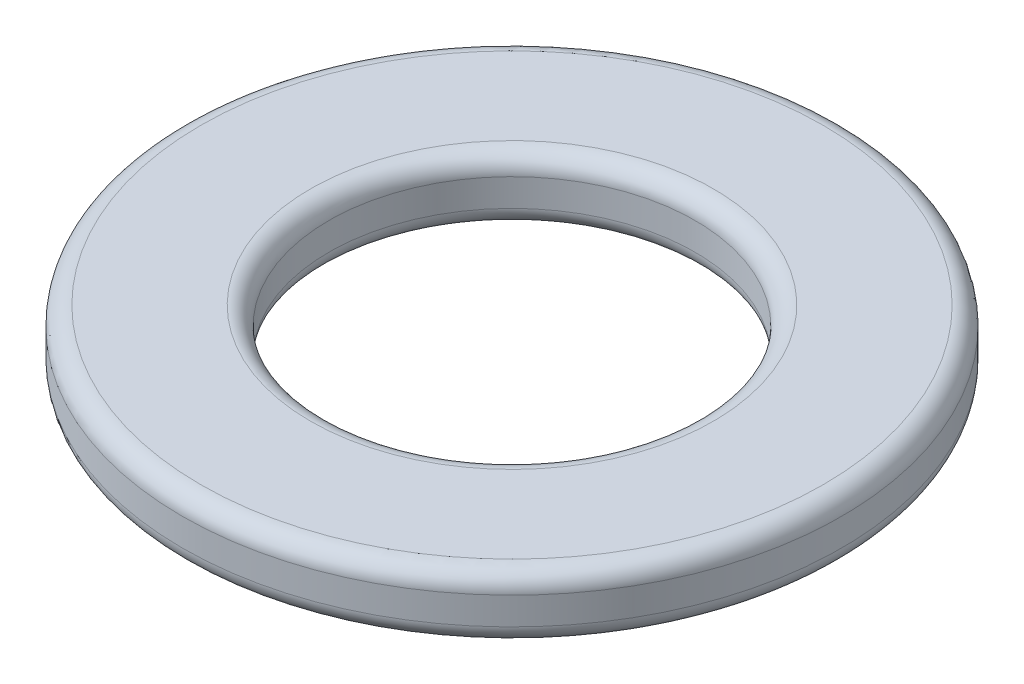
ISO-10303-21;
HEADER;
FILE_DESCRIPTION(('STEP AP214'),'2;1');
FILE_NAME('part.step','',(''),(''),'','','');
FILE_SCHEMA(('AUTOMOTIVE_DESIGN { 1 0 10303 214 1 1 1 1 }'));
ENDSEC;
DATA;
#1=APPLICATION_CONTEXT('core data for automotive mechanical design processes');
#2=APPLICATION_PROTOCOL_DEFINITION('international standard','automotive_design',2000,#1);
#3=PRODUCT_CONTEXT('',#1,'mechanical');
#4=PRODUCT('Part','Part','',(#3));
#5=PRODUCT_RELATED_PRODUCT_CATEGORY('part','',(#4));
#6=PRODUCT_DEFINITION_FORMATION('','',#4);
#7=PRODUCT_DEFINITION_CONTEXT('part definition',#1,'design');
#8=PRODUCT_DEFINITION('design','',#6,#7);
#9=PRODUCT_DEFINITION_SHAPE('','',#8);
#10=(LENGTH_UNIT() NAMED_UNIT(*) SI_UNIT(.MILLI.,.METRE.));
#11=(NAMED_UNIT(*) PLANE_ANGLE_UNIT() SI_UNIT($,.RADIAN.));
#12=(NAMED_UNIT(*) SI_UNIT($,.STERADIAN.) SOLID_ANGLE_UNIT());
#13=UNCERTAINTY_MEASURE_WITH_UNIT(LENGTH_MEASURE(1.E-05),#10,'distance_accuracy_value','');
#14=(GEOMETRIC_REPRESENTATION_CONTEXT(3) GLOBAL_UNCERTAINTY_ASSIGNED_CONTEXT((#13)) GLOBAL_UNIT_ASSIGNED_CONTEXT((#10,
#11,#12)) REPRESENTATION_CONTEXT('',''));
#15=CARTESIAN_POINT('',(0.,0.,0.));
#16=DIRECTION('',(0.,0.,1.));
#17=DIRECTION('',(1.,0.,0.));
#18=AXIS2_PLACEMENT_3D('',#15,#16,#17);
#19=CARTESIAN_POINT('',(0.,1.75,0.));
#20=DIRECTION('',(0.,1.,0.));
#21=DIRECTION('',(0.,0.,1.));
#22=AXIS2_PLACEMENT_3D('',#19,#20,#21);
#23=PLANE('',#22);
#24=CARTESIAN_POINT('',(0.,1.75,0.));
#25=DIRECTION('',(0.,1.,0.));
#26=DIRECTION('',(0.,0.,1.));
#27=AXIS2_PLACEMENT_3D('',#24,#25,#26);
#28=CIRCLE('',#27,5.5);
#29=CARTESIAN_POINT('',(0.,1.75,5.5));
#30=VERTEX_POINT('',#29);
#31=EDGE_CURVE('E61',#30,#30,#28,.F.);
#32=ORIENTED_EDGE('',*,*,#31,.T.);
#33=EDGE_LOOP('',(#32));
#34=FACE_BOUND('',#33,.T.);
#35=CARTESIAN_POINT('',(0.,1.75,0.));
#36=DIRECTION('',(0.,1.,0.));
#37=DIRECTION('',(0.,0.,1.));
#38=AXIS2_PLACEMENT_3D('',#35,#36,#37);
#39=CIRCLE('',#38,8.5);
#40=CARTESIAN_POINT('',(0.,1.75,8.5));
#41=VERTEX_POINT('',#40);
#42=EDGE_CURVE('E64',#41,#41,#39,.T.);
#43=ORIENTED_EDGE('',*,*,#42,.T.);
#44=EDGE_LOOP('',(#43));
#45=FACE_BOUND('',#44,.T.);
#46=ADVANCED_FACE('F41',(#34,#45),#23,.T.);
#47=CARTESIAN_POINT('',(0.,0.,0.));
#48=DIRECTION('',(0.,1.,0.));
#49=DIRECTION('',(0.,0.,1.));
#50=AXIS2_PLACEMENT_3D('',#47,#48,#49);
#51=PLANE('',#50);
#52=CARTESIAN_POINT('',(0.,0.,0.));
#53=DIRECTION('',(0.,1.,0.));
#54=DIRECTION('',(0.,0.,1.));
#55=AXIS2_PLACEMENT_3D('',#52,#53,#54);
#56=CIRCLE('',#55,8.5);
#57=CARTESIAN_POINT('',(0.,0.,8.5));
#58=VERTEX_POINT('',#57);
#59=EDGE_CURVE('E10',#58,#58,#56,.F.);
#60=ORIENTED_EDGE('',*,*,#59,.T.);
#61=EDGE_LOOP('',(#60));
#62=FACE_BOUND('',#61,.T.);
#63=CARTESIAN_POINT('',(0.,0.,0.));
#64=DIRECTION('',(0.,1.,0.));
#65=DIRECTION('',(0.,0.,1.));
#66=AXIS2_PLACEMENT_3D('',#63,#64,#65);
#67=CIRCLE('',#66,5.5);
#68=CARTESIAN_POINT('',(0.,0.,5.5));
#69=VERTEX_POINT('',#68);
#70=EDGE_CURVE('E48',#69,#69,#67,.T.);
#71=ORIENTED_EDGE('',*,*,#70,.T.);
#72=EDGE_LOOP('',(#71));
#73=FACE_BOUND('',#72,.T.);
#74=ADVANCED_FACE('F85',(#62,#73),#51,.F.);
#75=CARTESIAN_POINT('',(0.,1.75,0.));
#76=DIRECTION('',(0.,-1.,0.));
#77=DIRECTION('',(0.,0.,-1.));
#78=AXIS2_PLACEMENT_3D('',#75,#76,#77);
#79=CYLINDRICAL_SURFACE('',#78,9.);
#80=CARTESIAN_POINT('',(0.,1.25,0.));
#81=DIRECTION('',(0.,1.,0.));
#82=DIRECTION('',(0.,0.,1.));
#83=AXIS2_PLACEMENT_3D('',#80,#81,#82);
#84=CIRCLE('',#83,9.);
#85=CARTESIAN_POINT('',(0.,1.25,9.));
#86=VERTEX_POINT('',#85);
#87=EDGE_CURVE('E52',#86,#86,#84,.F.);
#88=ORIENTED_EDGE('',*,*,#87,.T.);
#89=EDGE_LOOP('',(#88));
#90=FACE_BOUND('',#89,.T.);
#91=CARTESIAN_POINT('',(0.,0.5,0.));
#92=DIRECTION('',(0.,1.,0.));
#93=DIRECTION('',(0.,0.,1.));
#94=AXIS2_PLACEMENT_3D('',#91,#92,#93);
#95=CIRCLE('',#94,9.);
#96=CARTESIAN_POINT('',(0.,0.5,9.));
#97=VERTEX_POINT('',#96);
#98=EDGE_CURVE('E56',#97,#97,#95,.T.);
#99=ORIENTED_EDGE('',*,*,#98,.T.);
#100=EDGE_LOOP('',(#99));
#101=FACE_BOUND('',#100,.T.);
#102=ADVANCED_FACE('F91',(#90,#101),#79,.T.);
#103=CARTESIAN_POINT('',(0.,1.75,0.));
#104=DIRECTION('',(0.,-1.,0.));
#105=DIRECTION('',(0.,0.,-1.));
#106=AXIS2_PLACEMENT_3D('',#103,#104,#105);
#107=CYLINDRICAL_SURFACE('',#106,5.);
#108=CARTESIAN_POINT('',(0.,1.25,0.));
#109=DIRECTION('',(0.,1.,0.));
#110=DIRECTION('',(0.,0.,1.));
#111=AXIS2_PLACEMENT_3D('',#108,#109,#110);
#112=CIRCLE('',#111,5.);
#113=CARTESIAN_POINT('',(0.,1.25,5.));
#114=VERTEX_POINT('',#113);
#115=EDGE_CURVE('E67',#114,#114,#112,.T.);
#116=ORIENTED_EDGE('',*,*,#115,.T.);
#117=EDGE_LOOP('',(#116));
#118=FACE_BOUND('',#117,.T.);
#119=CARTESIAN_POINT('',(0.,0.5,0.));
#120=DIRECTION('',(0.,1.,0.));
#121=DIRECTION('',(0.,0.,1.));
#122=AXIS2_PLACEMENT_3D('',#119,#120,#121);
#123=CIRCLE('',#122,5.);
#124=CARTESIAN_POINT('',(0.,0.5,5.));
#125=VERTEX_POINT('',#124);
#126=EDGE_CURVE('E70',#125,#125,#123,.F.);
#127=ORIENTED_EDGE('',*,*,#126,.T.);
#128=EDGE_LOOP('',(#127));
#129=FACE_BOUND('',#128,.T.);
#130=ADVANCED_FACE('F74',(#118,#129),#107,.F.);
#131=CARTESIAN_POINT('',(0.,1.25,0.));
#132=DIRECTION('',(0.,1.,0.));
#133=DIRECTION('',(0.,0.,1.));
#134=AXIS2_PLACEMENT_3D('',#131,#132,#133);
#135=TOROIDAL_SURFACE('',#134,5.5,0.5);
#136=ORIENTED_EDGE('',*,*,#31,.F.);
#137=EDGE_LOOP('',(#136));
#138=FACE_BOUND('',#137,.T.);
#139=ORIENTED_EDGE('',*,*,#115,.F.);
#140=EDGE_LOOP('',(#139));
#141=FACE_BOUND('',#140,.T.);
#142=ADVANCED_FACE('F99',(#138,#141),#135,.T.);
#143=CARTESIAN_POINT('',(0.,1.25,0.));
#144=DIRECTION('',(0.,1.,0.));
#145=DIRECTION('',(0.,0.,1.));
#146=AXIS2_PLACEMENT_3D('',#143,#144,#145);
#147=TOROIDAL_SURFACE('',#146,8.5,0.5);
#148=ORIENTED_EDGE('',*,*,#87,.F.);
#149=EDGE_LOOP('',(#148));
#150=FACE_BOUND('',#149,.T.);
#151=ORIENTED_EDGE('',*,*,#42,.F.);
#152=EDGE_LOOP('',(#151));
#153=FACE_BOUND('',#152,.T.);
#154=ADVANCED_FACE('F82',(#150,#153),#147,.T.);
#155=CARTESIAN_POINT('',(0.,0.5,0.));
#156=DIRECTION('',(0.,1.,0.));
#157=DIRECTION('',(0.,0.,1.));
#158=AXIS2_PLACEMENT_3D('',#155,#156,#157);
#159=TOROIDAL_SURFACE('',#158,8.5,0.5);
#160=ORIENTED_EDGE('',*,*,#59,.F.);
#161=EDGE_LOOP('',(#160));
#162=FACE_BOUND('',#161,.T.);
#163=ORIENTED_EDGE('',*,*,#98,.F.);
#164=EDGE_LOOP('',(#163));
#165=FACE_BOUND('',#164,.T.);
#166=ADVANCED_FACE('F78',(#162,#165),#159,.T.);
#167=CARTESIAN_POINT('',(0.,0.5,0.));
#168=DIRECTION('',(0.,1.,0.));
#169=DIRECTION('',(0.,0.,1.));
#170=AXIS2_PLACEMENT_3D('',#167,#168,#169);
#171=TOROIDAL_SURFACE('',#170,5.5,0.5);
#172=ORIENTED_EDGE('',*,*,#126,.F.);
#173=EDGE_LOOP('',(#172));
#174=FACE_BOUND('',#173,.T.);
#175=ORIENTED_EDGE('',*,*,#70,.F.);
#176=EDGE_LOOP('',(#175));
#177=FACE_BOUND('',#176,.T.);
#178=ADVANCED_FACE('F43',(#174,#177),#171,.T.);
#179=CLOSED_SHELL('',(#46,#74,#102,#130,#142,#154,#166,#178));
#180=MANIFOLD_SOLID_BREP('B2',#179);
#181=ADVANCED_BREP_SHAPE_REPRESENTATION('',(#18,#180),#14);
#182=SHAPE_DEFINITION_REPRESENTATION(#9,#181);
ENDSEC;
END-ISO-10303-21;
